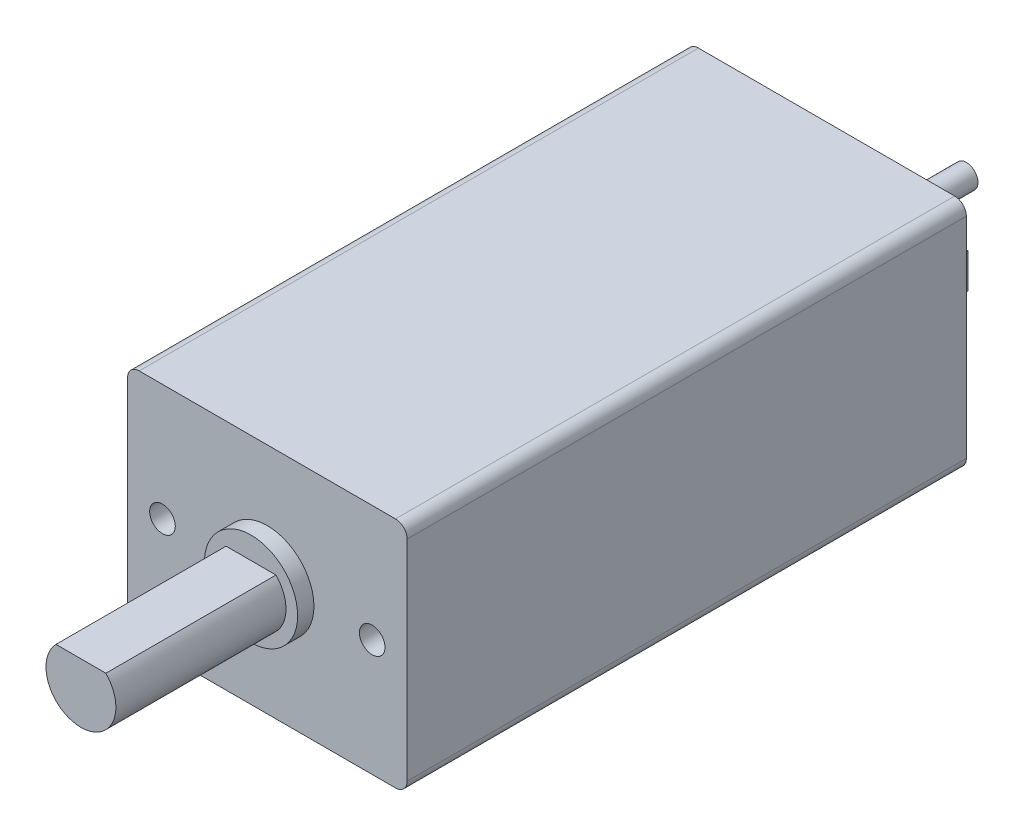
ISO-10303-21;
HEADER;
FILE_DESCRIPTION(('STEP AP214'),'2;1');
FILE_NAME('part.step','',(''),(''),'','','');
FILE_SCHEMA(('AUTOMOTIVE_DESIGN { 1 0 10303 214 1 1 1 1 }'));
ENDSEC;
DATA;
#1=APPLICATION_CONTEXT('core data for automotive mechanical design processes');
#2=APPLICATION_PROTOCOL_DEFINITION('international standard','automotive_design',2000,#1);
#3=PRODUCT_CONTEXT('',#1,'mechanical');
#4=PRODUCT('Part','Part','',(#3));
#5=PRODUCT_RELATED_PRODUCT_CATEGORY('part','',(#4));
#6=PRODUCT_DEFINITION_FORMATION('','',#4);
#7=PRODUCT_DEFINITION_CONTEXT('part definition',#1,'design');
#8=PRODUCT_DEFINITION('design','',#6,#7);
#9=PRODUCT_DEFINITION_SHAPE('','',#8);
#10=(LENGTH_UNIT() NAMED_UNIT(*) SI_UNIT(.MILLI.,.METRE.));
#11=(NAMED_UNIT(*) PLANE_ANGLE_UNIT() SI_UNIT($,.RADIAN.));
#12=(NAMED_UNIT(*) SI_UNIT($,.STERADIAN.) SOLID_ANGLE_UNIT());
#13=UNCERTAINTY_MEASURE_WITH_UNIT(LENGTH_MEASURE(1.E-05),#10,'distance_accuracy_value','');
#14=(GEOMETRIC_REPRESENTATION_CONTEXT(3) GLOBAL_UNCERTAINTY_ASSIGNED_CONTEXT((#13)) GLOBAL_UNIT_ASSIGNED_CONTEXT((#10,
#11,#12)) REPRESENTATION_CONTEXT('',''));
#15=CARTESIAN_POINT('',(0.,0.,0.));
#16=DIRECTION('',(0.,0.,1.));
#17=DIRECTION('',(1.,0.,0.));
#18=AXIS2_PLACEMENT_3D('',#15,#16,#17);
#19=CARTESIAN_POINT('',(0.,0.,-24.));
#20=DIRECTION('',(0.,0.,1.));
#21=DIRECTION('',(1.,0.,0.));
#22=AXIS2_PLACEMENT_3D('',#19,#20,#21);
#23=PLANE('',#22);
#24=DIRECTION('',(0.,1.,0.));
#25=VECTOR('',#24,1.);
#26=CARTESIAN_POINT('',(3.44,0.75,-24.));
#27=LINE('',#26,#25);
#28=CARTESIAN_POINT('',(3.44,-0.75,-24.));
#29=VERTEX_POINT('',#28);
#30=CARTESIAN_POINT('',(3.44,0.75,-24.));
#31=VERTEX_POINT('',#30);
#32=EDGE_CURVE('E187',#29,#31,#27,.T.);
#33=ORIENTED_EDGE('',*,*,#32,.F.);
#34=DIRECTION('',(-1.,0.,0.));
#35=VECTOR('',#34,1.);
#36=CARTESIAN_POINT('',(3.56,-0.75,-24.));
#37=LINE('',#36,#35);
#38=CARTESIAN_POINT('',(3.56,-0.75,-24.));
#39=VERTEX_POINT('',#38);
#40=EDGE_CURVE('E200',#39,#29,#37,.T.);
#41=ORIENTED_EDGE('',*,*,#40,.F.);
#42=DIRECTION('',(0.,-1.,0.));
#43=VECTOR('',#42,1.);
#44=CARTESIAN_POINT('',(3.56,0.75,-24.));
#45=LINE('',#44,#43);
#46=CARTESIAN_POINT('',(3.56,0.75,-24.));
#47=VERTEX_POINT('',#46);
#48=EDGE_CURVE('E209',#47,#39,#45,.T.);
#49=ORIENTED_EDGE('',*,*,#48,.F.);
#50=DIRECTION('',(1.,0.,0.));
#51=VECTOR('',#50,1.);
#52=CARTESIAN_POINT('',(3.56,0.75,-24.));
#53=LINE('',#52,#51);
#54=EDGE_CURVE('E190',#31,#47,#53,.T.);
#55=ORIENTED_EDGE('',*,*,#54,.F.);
#56=EDGE_LOOP('',(#33,#41,#49,#55));
#57=FACE_BOUND('',#56,.T.);
#58=DIRECTION('',(0.,-1.,0.));
#59=VECTOR('',#58,1.);
#60=CARTESIAN_POINT('',(-6.,5.,-24.));
#61=LINE('',#60,#59);
#62=CARTESIAN_POINT('',(-6.,4.5,-24.));
#63=VERTEX_POINT('',#62);
#64=CARTESIAN_POINT('',(-6.,-4.5,-24.));
#65=VERTEX_POINT('',#64);
#66=EDGE_CURVE('E260',#63,#65,#61,.T.);
#67=ORIENTED_EDGE('',*,*,#66,.F.);
#68=CARTESIAN_POINT('',(-5.5,4.5,-24.));
#69=DIRECTION('',(0.,0.,1.));
#70=DIRECTION('',(1.,0.,0.));
#71=AXIS2_PLACEMENT_3D('',#68,#69,#70);
#72=CIRCLE('',#71,0.5);
#73=CARTESIAN_POINT('',(-5.5,5.,-24.));
#74=VERTEX_POINT('',#73);
#75=EDGE_CURVE('E313',#63,#74,#72,.F.);
#76=ORIENTED_EDGE('',*,*,#75,.T.);
#77=DIRECTION('',(-1.,0.,0.));
#78=VECTOR('',#77,1.);
#79=CARTESIAN_POINT('',(-6.,5.,-24.));
#80=LINE('',#79,#78);
#81=CARTESIAN_POINT('',(5.5,5.,-24.));
#82=VERTEX_POINT('',#81);
#83=EDGE_CURVE('E270',#82,#74,#80,.T.);
#84=ORIENTED_EDGE('',*,*,#83,.F.);
#85=CARTESIAN_POINT('',(5.5,4.5,-24.));
#86=DIRECTION('',(0.,0.,1.));
#87=DIRECTION('',(1.,0.,0.));
#88=AXIS2_PLACEMENT_3D('',#85,#86,#87);
#89=CIRCLE('',#88,0.5);
#90=CARTESIAN_POINT('',(6.,4.5,-24.));
#91=VERTEX_POINT('',#90);
#92=EDGE_CURVE('E311',#82,#91,#89,.F.);
#93=ORIENTED_EDGE('',*,*,#92,.T.);
#94=DIRECTION('',(0.,1.,0.));
#95=VECTOR('',#94,1.);
#96=CARTESIAN_POINT('',(6.,5.,-24.));
#97=LINE('',#96,#95);
#98=CARTESIAN_POINT('',(6.,-4.5,-24.));
#99=VERTEX_POINT('',#98);
#100=EDGE_CURVE('E267',#99,#91,#97,.T.);
#101=ORIENTED_EDGE('',*,*,#100,.F.);
#102=CARTESIAN_POINT('',(5.5,-4.5,-24.));
#103=DIRECTION('',(0.,0.,1.));
#104=DIRECTION('',(1.,0.,0.));
#105=AXIS2_PLACEMENT_3D('',#102,#103,#104);
#106=CIRCLE('',#105,0.5);
#107=CARTESIAN_POINT('',(5.5,-5.,-24.));
#108=VERTEX_POINT('',#107);
#109=EDGE_CURVE('E309',#99,#108,#106,.F.);
#110=ORIENTED_EDGE('',*,*,#109,.T.);
#111=DIRECTION('',(1.,0.,0.));
#112=VECTOR('',#111,1.);
#113=CARTESIAN_POINT('',(-6.,-5.,-24.));
#114=LINE('',#113,#112);
#115=CARTESIAN_POINT('',(-5.5,-5.,-24.));
#116=VERTEX_POINT('',#115);
#117=EDGE_CURVE('E263',#116,#108,#114,.T.);
#118=ORIENTED_EDGE('',*,*,#117,.F.);
#119=CARTESIAN_POINT('',(-5.5,-4.5,-24.));
#120=DIRECTION('',(0.,0.,1.));
#121=DIRECTION('',(1.,0.,0.));
#122=AXIS2_PLACEMENT_3D('',#119,#120,#121);
#123=CIRCLE('',#122,0.5);
#124=EDGE_CURVE('E307',#116,#65,#123,.F.);
#125=ORIENTED_EDGE('',*,*,#124,.T.);
#126=EDGE_LOOP('',(#67,#76,#84,#93,#101,#110,#118,#125));
#127=FACE_BOUND('',#126,.T.);
#128=CARTESIAN_POINT('',(0.,0.,-24.));
#129=DIRECTION('',(0.,0.,1.));
#130=DIRECTION('',(1.,0.,0.));
#131=AXIS2_PLACEMENT_3D('',#128,#129,#130);
#132=CIRCLE('',#131,2.5);
#133=CARTESIAN_POINT('',(2.5,0.,-24.));
#134=VERTEX_POINT('',#133);
#135=EDGE_CURVE('E11',#134,#134,#132,.F.);
#136=ORIENTED_EDGE('',*,*,#135,.F.);
#137=EDGE_LOOP('',(#136));
#138=FACE_BOUND('',#137,.T.);
#139=DIRECTION('',(0.,1.,0.));
#140=VECTOR('',#139,1.);
#141=CARTESIAN_POINT('',(-3.56,0.75,-24.));
#142=LINE('',#141,#140);
#143=CARTESIAN_POINT('',(-3.56,-0.75,-24.));
#144=VERTEX_POINT('',#143);
#145=CARTESIAN_POINT('',(-3.56,0.75,-24.));
#146=VERTEX_POINT('',#145);
#147=EDGE_CURVE('E186',#144,#146,#142,.T.);
#148=ORIENTED_EDGE('',*,*,#147,.F.);
#149=DIRECTION('',(-1.,0.,0.));
#150=VECTOR('',#149,1.);
#151=CARTESIAN_POINT('',(-3.44,-0.75,-24.));
#152=LINE('',#151,#150);
#153=CARTESIAN_POINT('',(-3.44,-0.75,-24.));
#154=VERTEX_POINT('',#153);
#155=EDGE_CURVE('E183',#154,#144,#152,.T.);
#156=ORIENTED_EDGE('',*,*,#155,.F.);
#157=DIRECTION('',(0.,-1.,0.));
#158=VECTOR('',#157,1.);
#159=CARTESIAN_POINT('',(-3.44,0.75,-24.));
#160=LINE('',#159,#158);
#161=CARTESIAN_POINT('',(-3.44,0.75,-24.));
#162=VERTEX_POINT('',#161);
#163=EDGE_CURVE('E55',#162,#154,#160,.T.);
#164=ORIENTED_EDGE('',*,*,#163,.F.);
#165=DIRECTION('',(1.,0.,0.));
#166=VECTOR('',#165,1.);
#167=CARTESIAN_POINT('',(-3.44,0.75,-24.));
#168=LINE('',#167,#166);
#169=EDGE_CURVE('E50',#146,#162,#168,.T.);
#170=ORIENTED_EDGE('',*,*,#169,.F.);
#171=EDGE_LOOP('',(#148,#156,#164,#170));
#172=FACE_BOUND('',#171,.T.);
#173=ADVANCED_FACE('F34',(#57,#127,#138,#172),#23,.F.);
#174=CARTESIAN_POINT('',(0.,0.,-25.2));
#175=DIRECTION('',(0.,0.,-1.));
#176=DIRECTION('',(-1.,0.,0.));
#177=AXIS2_PLACEMENT_3D('',#174,#175,#176);
#178=PLANE('',#177);
#179=CARTESIAN_POINT('',(0.,0.,-25.2));
#180=DIRECTION('',(0.,0.,-1.));
#181=DIRECTION('',(-1.,0.,0.));
#182=AXIS2_PLACEMENT_3D('',#179,#180,#181);
#183=CIRCLE('',#182,2.5);
#184=CARTESIAN_POINT('',(-2.5,0.,-25.2));
#185=VERTEX_POINT('',#184);
#186=EDGE_CURVE('E228',#185,#185,#183,.T.);
#187=ORIENTED_EDGE('',*,*,#186,.T.);
#188=EDGE_LOOP('',(#187));
#189=FACE_BOUND('',#188,.T.);
#190=CARTESIAN_POINT('',(0.,0.,-25.2));
#191=DIRECTION('',(0.,0.,-1.));
#192=DIRECTION('',(-1.,0.,0.));
#193=AXIS2_PLACEMENT_3D('',#190,#191,#192);
#194=CIRCLE('',#193,0.5);
#195=CARTESIAN_POINT('',(-0.5,0.,-25.2));
#196=VERTEX_POINT('',#195);
#197=EDGE_CURVE('E38',#196,#196,#194,.F.);
#198=ORIENTED_EDGE('',*,*,#197,.T.);
#199=EDGE_LOOP('',(#198));
#200=FACE_BOUND('',#199,.T.);
#201=ADVANCED_FACE('F371',(#189,#200),#178,.T.);
#202=CARTESIAN_POINT('',(0.,0.,0.7));
#203=DIRECTION('',(0.,0.,1.));
#204=DIRECTION('',(1.,0.,0.));
#205=AXIS2_PLACEMENT_3D('',#202,#203,#204);
#206=PLANE('',#205);
#207=CARTESIAN_POINT('',(0.,0.,0.7));
#208=DIRECTION('',(0.,0.,1.));
#209=DIRECTION('',(1.,0.,0.));
#210=AXIS2_PLACEMENT_3D('',#207,#208,#209);
#211=CIRCLE('',#210,2.);
#212=CARTESIAN_POINT('',(2.,0.,0.7));
#213=VERTEX_POINT('',#212);
#214=EDGE_CURVE('E254',#213,#213,#211,.T.);
#215=ORIENTED_EDGE('',*,*,#214,.T.);
#216=EDGE_LOOP('',(#215));
#217=FACE_BOUND('',#216,.T.);
#218=DIRECTION('',(1.,0.,0.));
#219=VECTOR('',#218,1.);
#220=CARTESIAN_POINT('',(0.,1.05,0.7));
#221=LINE('',#220,#219);
#222=CARTESIAN_POINT('',(-1.07121426428143,1.05,0.7));
#223=VERTEX_POINT('',#222);
#224=CARTESIAN_POINT('',(1.07121426428143,1.05,0.7));
#225=VERTEX_POINT('',#224);
#226=EDGE_CURVE('E273',#223,#225,#221,.T.);
#227=ORIENTED_EDGE('',*,*,#226,.T.);
#228=CARTESIAN_POINT('',(0.,0.,0.7));
#229=DIRECTION('',(0.,0.,1.));
#230=DIRECTION('',(1.,0.,0.));
#231=AXIS2_PLACEMENT_3D('',#228,#229,#230);
#232=CIRCLE('',#231,1.5);
#233=EDGE_CURVE('E286',#225,#223,#232,.F.);
#234=ORIENTED_EDGE('',*,*,#233,.T.);
#235=EDGE_LOOP('',(#227,#234));
#236=FACE_BOUND('',#235,.T.);
#237=ADVANCED_FACE('F377',(#217,#236),#206,.T.);
#238=CARTESIAN_POINT('',(0.,0.,0.));
#239=DIRECTION('',(0.,0.,1.));
#240=DIRECTION('',(1.,0.,0.));
#241=AXIS2_PLACEMENT_3D('',#238,#239,#240);
#242=PLANE('',#241);
#243=CARTESIAN_POINT('',(4.5,0.,0.));
#244=DIRECTION('',(0.,0.,1.));
#245=DIRECTION('',(1.,0.,0.));
#246=AXIS2_PLACEMENT_3D('',#243,#244,#245);
#247=CIRCLE('',#246,0.54999999999999);
#248=CARTESIAN_POINT('',(5.04999999999999,0.,0.));
#249=VERTEX_POINT('',#248);
#250=EDGE_CURVE('E241',#249,#249,#247,.T.);
#251=ORIENTED_EDGE('',*,*,#250,.F.);
#252=EDGE_LOOP('',(#251));
#253=FACE_BOUND('',#252,.T.);
#254=CARTESIAN_POINT('',(-4.5,0.,0.));
#255=DIRECTION('',(0.,0.,1.));
#256=DIRECTION('',(1.,0.,0.));
#257=AXIS2_PLACEMENT_3D('',#254,#255,#256);
#258=CIRCLE('',#257,0.549999999999998);
#259=CARTESIAN_POINT('',(-3.95,0.,0.));
#260=VERTEX_POINT('',#259);
#261=EDGE_CURVE('E247',#260,#260,#258,.T.);
#262=ORIENTED_EDGE('',*,*,#261,.F.);
#263=EDGE_LOOP('',(#262));
#264=FACE_BOUND('',#263,.T.);
#265=DIRECTION('',(-1.,0.,0.));
#266=VECTOR('',#265,1.);
#267=CARTESIAN_POINT('',(-6.,5.,0.));
#268=LINE('',#267,#266);
#269=CARTESIAN_POINT('',(5.5,5.,0.));
#270=VERTEX_POINT('',#269);
#271=CARTESIAN_POINT('',(-5.5,5.,0.));
#272=VERTEX_POINT('',#271);
#273=EDGE_CURVE('E264',#270,#272,#268,.T.);
#274=ORIENTED_EDGE('',*,*,#273,.T.);
#275=CARTESIAN_POINT('',(-5.5,4.5,0.));
#276=DIRECTION('',(0.,0.,1.));
#277=DIRECTION('',(1.,0.,0.));
#278=AXIS2_PLACEMENT_3D('',#275,#276,#277);
#279=CIRCLE('',#278,0.5);
#280=CARTESIAN_POINT('',(-6.,4.5,0.));
#281=VERTEX_POINT('',#280);
#282=EDGE_CURVE('E300',#272,#281,#279,.T.);
#283=ORIENTED_EDGE('',*,*,#282,.T.);
#284=DIRECTION('',(0.,-1.,0.));
#285=VECTOR('',#284,1.);
#286=CARTESIAN_POINT('',(-6.,5.,0.));
#287=LINE('',#286,#285);
#288=CARTESIAN_POINT('',(-6.,-4.5,0.));
#289=VERTEX_POINT('',#288);
#290=EDGE_CURVE('E257',#281,#289,#287,.T.);
#291=ORIENTED_EDGE('',*,*,#290,.T.);
#292=CARTESIAN_POINT('',(-5.5,-4.5,0.));
#293=DIRECTION('',(0.,0.,1.));
#294=DIRECTION('',(1.,0.,0.));
#295=AXIS2_PLACEMENT_3D('',#292,#293,#294);
#296=CIRCLE('',#295,0.5);
#297=CARTESIAN_POINT('',(-5.5,-5.,0.));
#298=VERTEX_POINT('',#297);
#299=EDGE_CURVE('E294',#289,#298,#296,.T.);
#300=ORIENTED_EDGE('',*,*,#299,.T.);
#301=DIRECTION('',(1.,0.,0.));
#302=VECTOR('',#301,1.);
#303=CARTESIAN_POINT('',(-6.,-5.,0.));
#304=LINE('',#303,#302);
#305=CARTESIAN_POINT('',(5.5,-5.,0.));
#306=VERTEX_POINT('',#305);
#307=EDGE_CURVE('E276',#298,#306,#304,.T.);
#308=ORIENTED_EDGE('',*,*,#307,.T.);
#309=CARTESIAN_POINT('',(5.5,-4.5,0.));
#310=DIRECTION('',(0.,0.,1.));
#311=DIRECTION('',(1.,0.,0.));
#312=AXIS2_PLACEMENT_3D('',#309,#310,#311);
#313=CIRCLE('',#312,0.5);
#314=CARTESIAN_POINT('',(6.,-4.5,0.));
#315=VERTEX_POINT('',#314);
#316=EDGE_CURVE('E296',#306,#315,#313,.T.);
#317=ORIENTED_EDGE('',*,*,#316,.T.);
#318=DIRECTION('',(0.,1.,0.));
#319=VECTOR('',#318,1.);
#320=CARTESIAN_POINT('',(6.,5.,0.));
#321=LINE('',#320,#319);
#322=CARTESIAN_POINT('',(6.,4.5,0.));
#323=VERTEX_POINT('',#322);
#324=EDGE_CURVE('E279',#315,#323,#321,.T.);
#325=ORIENTED_EDGE('',*,*,#324,.T.);
#326=CARTESIAN_POINT('',(5.5,4.5,0.));
#327=DIRECTION('',(0.,0.,1.));
#328=DIRECTION('',(1.,0.,0.));
#329=AXIS2_PLACEMENT_3D('',#326,#327,#328);
#330=CIRCLE('',#329,0.5);
#331=EDGE_CURVE('E298',#323,#270,#330,.T.);
#332=ORIENTED_EDGE('',*,*,#331,.T.);
#333=EDGE_LOOP('',(#274,#283,#291,#300,#308,#317,#325,#332));
#334=FACE_BOUND('',#333,.T.);
#335=CARTESIAN_POINT('',(0.,0.,0.));
#336=DIRECTION('',(0.,0.,1.));
#337=DIRECTION('',(1.,0.,0.));
#338=AXIS2_PLACEMENT_3D('',#335,#336,#337);
#339=CIRCLE('',#338,2.);
#340=CARTESIAN_POINT('',(2.,0.,0.));
#341=VERTEX_POINT('',#340);
#342=EDGE_CURVE('E253',#341,#341,#339,.T.);
#343=ORIENTED_EDGE('',*,*,#342,.F.);
#344=EDGE_LOOP('',(#343));
#345=FACE_BOUND('',#344,.T.);
#346=ADVANCED_FACE('F332',(#253,#264,#334,#345),#242,.T.);
#347=CARTESIAN_POINT('',(-6.,5.,-24.));
#348=DIRECTION('',(-1.,0.,0.));
#349=DIRECTION('',(0.,-1.,0.));
#350=AXIS2_PLACEMENT_3D('',#347,#348,#349);
#351=PLANE('',#350);
#352=ORIENTED_EDGE('',*,*,#290,.F.);
#353=DIRECTION('',(0.,0.,1.));
#354=VECTOR('',#353,1.);
#355=CARTESIAN_POINT('',(-6.,4.5,-24.));
#356=LINE('',#355,#354);
#357=EDGE_CURVE('E305',#281,#63,#356,.F.);
#358=ORIENTED_EDGE('',*,*,#357,.T.);
#359=ORIENTED_EDGE('',*,*,#66,.T.);
#360=DIRECTION('',(0.,0.,1.));
#361=VECTOR('',#360,1.);
#362=CARTESIAN_POINT('',(-6.,-4.5,-24.));
#363=LINE('',#362,#361);
#364=EDGE_CURVE('E302',#65,#289,#363,.T.);
#365=ORIENTED_EDGE('',*,*,#364,.T.);
#366=EDGE_LOOP('',(#352,#358,#359,#365));
#367=FACE_BOUND('',#366,.T.);
#368=ADVANCED_FACE('F340',(#367),#351,.T.);
#369=CARTESIAN_POINT('',(-6.,5.,-24.));
#370=DIRECTION('',(0.,1.,0.));
#371=DIRECTION('',(0.,0.,1.));
#372=AXIS2_PLACEMENT_3D('',#369,#370,#371);
#373=PLANE('',#372);
#374=ORIENTED_EDGE('',*,*,#83,.T.);
#375=DIRECTION('',(0.,0.,1.));
#376=VECTOR('',#375,1.);
#377=CARTESIAN_POINT('',(-5.5,5.,-24.));
#378=LINE('',#377,#376);
#379=EDGE_CURVE('E291',#74,#272,#378,.T.);
#380=ORIENTED_EDGE('',*,*,#379,.T.);
#381=ORIENTED_EDGE('',*,*,#273,.F.);
#382=DIRECTION('',(0.,0.,1.));
#383=VECTOR('',#382,1.);
#384=CARTESIAN_POINT('',(5.5,5.,-24.));
#385=LINE('',#384,#383);
#386=EDGE_CURVE('E289',#270,#82,#385,.F.);
#387=ORIENTED_EDGE('',*,*,#386,.T.);
#388=EDGE_LOOP('',(#374,#380,#381,#387));
#389=FACE_BOUND('',#388,.T.);
#390=ADVANCED_FACE('F352',(#389),#373,.T.);
#391=CARTESIAN_POINT('',(6.,5.,-24.));
#392=DIRECTION('',(1.,0.,0.));
#393=DIRECTION('',(0.,1.,0.));
#394=AXIS2_PLACEMENT_3D('',#391,#392,#393);
#395=PLANE('',#394);
#396=ORIENTED_EDGE('',*,*,#100,.T.);
#397=DIRECTION('',(0.,0.,1.));
#398=VECTOR('',#397,1.);
#399=CARTESIAN_POINT('',(6.,4.5,-24.));
#400=LINE('',#399,#398);
#401=EDGE_CURVE('E317',#91,#323,#400,.T.);
#402=ORIENTED_EDGE('',*,*,#401,.T.);
#403=ORIENTED_EDGE('',*,*,#324,.F.);
#404=DIRECTION('',(0.,0.,1.));
#405=VECTOR('',#404,1.);
#406=CARTESIAN_POINT('',(6.,-4.5,-24.));
#407=LINE('',#406,#405);
#408=EDGE_CURVE('E315',#315,#99,#407,.F.);
#409=ORIENTED_EDGE('',*,*,#408,.T.);
#410=EDGE_LOOP('',(#396,#402,#403,#409));
#411=FACE_BOUND('',#410,.T.);
#412=ADVANCED_FACE('F359',(#411),#395,.T.);
#413=CARTESIAN_POINT('',(-6.,-5.,-24.));
#414=DIRECTION('',(0.,-1.,0.));
#415=DIRECTION('',(0.,0.,-1.));
#416=AXIS2_PLACEMENT_3D('',#413,#414,#415);
#417=PLANE('',#416);
#418=ORIENTED_EDGE('',*,*,#117,.T.);
#419=DIRECTION('',(0.,0.,1.));
#420=VECTOR('',#419,1.);
#421=CARTESIAN_POINT('',(5.5,-5.,-24.));
#422=LINE('',#421,#420);
#423=EDGE_CURVE('E43',#108,#306,#422,.T.);
#424=ORIENTED_EDGE('',*,*,#423,.T.);
#425=ORIENTED_EDGE('',*,*,#307,.F.);
#426=DIRECTION('',(0.,0.,1.));
#427=VECTOR('',#426,1.);
#428=CARTESIAN_POINT('',(-5.5,-5.,-24.));
#429=LINE('',#428,#427);
#430=EDGE_CURVE('E320',#298,#116,#429,.F.);
#431=ORIENTED_EDGE('',*,*,#430,.T.);
#432=EDGE_LOOP('',(#418,#424,#425,#431));
#433=FACE_BOUND('',#432,.T.);
#434=ADVANCED_FACE('F326',(#433),#417,.T.);
#435=CARTESIAN_POINT('',(0.,0.,0.7));
#436=DIRECTION('',(0.,0.,-1.));
#437=DIRECTION('',(-1.,0.,0.));
#438=AXIS2_PLACEMENT_3D('',#435,#436,#437);
#439=CYLINDRICAL_SURFACE('',#438,2.);
#440=ORIENTED_EDGE('',*,*,#214,.F.);
#441=EDGE_LOOP('',(#440));
#442=FACE_BOUND('',#441,.T.);
#443=ORIENTED_EDGE('',*,*,#342,.T.);
#444=EDGE_LOOP('',(#443));
#445=FACE_BOUND('',#444,.T.);
#446=ADVANCED_FACE('F382',(#442,#445),#439,.T.);
#447=CARTESIAN_POINT('',(-4.5,0.,-10.));
#448=DIRECTION('',(0.,0.,1.));
#449=DIRECTION('',(1.,0.,0.));
#450=AXIS2_PLACEMENT_3D('',#447,#448,#449);
#451=CONICAL_SURFACE('',#450,0.549999999999997,1.02101761241668);
#452=CARTESIAN_POINT('',(-4.5,0.,-10.337040433477));
#453=VERTEX_POINT('',#452);
#454=VERTEX_LOOP('',#453);
#455=FACE_BOUND('',#454,.T.);
#456=CARTESIAN_POINT('',(-4.5,0.,-10.));
#457=DIRECTION('',(0.,0.,1.));
#458=DIRECTION('',(1.,0.,0.));
#459=AXIS2_PLACEMENT_3D('',#456,#457,#458);
#460=CIRCLE('',#459,0.549999999999997);
#461=CARTESIAN_POINT('',(-3.95,0.,-10.));
#462=VERTEX_POINT('',#461);
#463=EDGE_CURVE('E250',#462,#462,#460,.T.);
#464=ORIENTED_EDGE('',*,*,#463,.T.);
#465=EDGE_LOOP('',(#464));
#466=FACE_BOUND('',#465,.T.);
#467=ADVANCED_FACE('F425',(#455,#466),#451,.F.);
#468=CARTESIAN_POINT('',(-4.5,0.,0.));
#469=DIRECTION('',(0.,0.,1.));
#470=DIRECTION('',(1.,0.,0.));
#471=AXIS2_PLACEMENT_3D('',#468,#469,#470);
#472=CYLINDRICAL_SURFACE('',#471,0.549999999999998);
#473=ORIENTED_EDGE('',*,*,#463,.F.);
#474=EDGE_LOOP('',(#473));
#475=FACE_BOUND('',#474,.T.);
#476=ORIENTED_EDGE('',*,*,#261,.T.);
#477=EDGE_LOOP('',(#476));
#478=FACE_BOUND('',#477,.T.);
#479=ADVANCED_FACE('F421',(#475,#478),#472,.F.);
#480=CARTESIAN_POINT('',(4.5,0.,-9.99999999999999));
#481=DIRECTION('',(0.,0.,1.));
#482=DIRECTION('',(1.,0.,0.));
#483=AXIS2_PLACEMENT_3D('',#480,#481,#482);
#484=CONICAL_SURFACE('',#483,0.549999999999988,1.02101761241666);
#485=CARTESIAN_POINT('',(4.5,0.,-10.337040433477));
#486=VERTEX_POINT('',#485);
#487=VERTEX_LOOP('',#486);
#488=FACE_BOUND('',#487,.T.);
#489=CARTESIAN_POINT('',(4.5,0.,-9.99999999999999));
#490=DIRECTION('',(0.,0.,1.));
#491=DIRECTION('',(1.,0.,0.));
#492=AXIS2_PLACEMENT_3D('',#489,#490,#491);
#493=CIRCLE('',#492,0.549999999999988);
#494=CARTESIAN_POINT('',(5.04999999999999,0.,-9.99999999999999));
#495=VERTEX_POINT('',#494);
#496=EDGE_CURVE('E244',#495,#495,#493,.T.);
#497=ORIENTED_EDGE('',*,*,#496,.T.);
#498=EDGE_LOOP('',(#497));
#499=FACE_BOUND('',#498,.T.);
#500=ADVANCED_FACE('F417',(#488,#499),#484,.F.);
#501=CARTESIAN_POINT('',(4.5,0.,0.));
#502=DIRECTION('',(0.,0.,1.));
#503=DIRECTION('',(1.,0.,0.));
#504=AXIS2_PLACEMENT_3D('',#501,#502,#503);
#505=CYLINDRICAL_SURFACE('',#504,0.549999999999989);
#506=ORIENTED_EDGE('',*,*,#496,.F.);
#507=EDGE_LOOP('',(#506));
#508=FACE_BOUND('',#507,.T.);
#509=ORIENTED_EDGE('',*,*,#250,.T.);
#510=EDGE_LOOP('',(#509));
#511=FACE_BOUND('',#510,.T.);
#512=ADVANCED_FACE('F413',(#508,#511),#505,.F.);
#513=CARTESIAN_POINT('',(0.,0.,8.));
#514=DIRECTION('',(0.,0.,-1.));
#515=DIRECTION('',(-1.,0.,0.));
#516=AXIS2_PLACEMENT_3D('',#513,#514,#515);
#517=CYLINDRICAL_SURFACE('',#516,1.5);
#518=ORIENTED_EDGE('',*,*,#233,.F.);
#519=DIRECTION('',(0.,0.,-1.));
#520=VECTOR('',#519,1.);
#521=CARTESIAN_POINT('',(1.07121426428143,1.05,8.));
#522=LINE('',#521,#520);
#523=CARTESIAN_POINT('',(1.07121426428143,1.05,8.));
#524=VERTEX_POINT('',#523);
#525=EDGE_CURVE('E239',#524,#225,#522,.T.);
#526=ORIENTED_EDGE('',*,*,#525,.F.);
#527=CARTESIAN_POINT('',(0.,0.,8.));
#528=DIRECTION('',(0.,0.,1.));
#529=DIRECTION('',(1.,0.,0.));
#530=AXIS2_PLACEMENT_3D('',#527,#528,#529);
#531=CIRCLE('',#530,1.5);
#532=CARTESIAN_POINT('',(-1.07121426428143,1.05,8.));
#533=VERTEX_POINT('',#532);
#534=EDGE_CURVE('E231',#533,#524,#531,.T.);
#535=ORIENTED_EDGE('',*,*,#534,.F.);
#536=DIRECTION('',(0.,0.,-1.));
#537=VECTOR('',#536,1.);
#538=CARTESIAN_POINT('',(-1.07121426428143,1.05,8.));
#539=LINE('',#538,#537);
#540=EDGE_CURVE('E236',#533,#223,#539,.T.);
#541=ORIENTED_EDGE('',*,*,#540,.T.);
#542=EDGE_LOOP('',(#518,#526,#535,#541));
#543=FACE_BOUND('',#542,.T.);
#544=ADVANCED_FACE('F406',(#543),#517,.T.);
#545=CARTESIAN_POINT('',(-1.07121426428143,1.05,8.));
#546=DIRECTION('',(0.,-1.,0.));
#547=DIRECTION('',(0.,0.,-1.));
#548=AXIS2_PLACEMENT_3D('',#545,#546,#547);
#549=PLANE('',#548);
#550=ORIENTED_EDGE('',*,*,#226,.F.);
#551=ORIENTED_EDGE('',*,*,#540,.F.);
#552=DIRECTION('',(-1.,0.,0.));
#553=VECTOR('',#552,1.);
#554=CARTESIAN_POINT('',(-1.07121426428143,1.05,8.));
#555=LINE('',#554,#553);
#556=EDGE_CURVE('E234',#524,#533,#555,.T.);
#557=ORIENTED_EDGE('',*,*,#556,.F.);
#558=ORIENTED_EDGE('',*,*,#525,.T.);
#559=EDGE_LOOP('',(#550,#551,#557,#558));
#560=FACE_BOUND('',#559,.T.);
#561=ADVANCED_FACE('F400',(#560),#549,.F.);
#562=CARTESIAN_POINT('',(0.,0.,8.));
#563=DIRECTION('',(0.,0.,1.));
#564=DIRECTION('',(1.,0.,0.));
#565=AXIS2_PLACEMENT_3D('',#562,#563,#564);
#566=PLANE('',#565);
#567=ORIENTED_EDGE('',*,*,#534,.T.);
#568=ORIENTED_EDGE('',*,*,#556,.T.);
#569=EDGE_LOOP('',(#567,#568));
#570=FACE_BOUND('',#569,.T.);
#571=ADVANCED_FACE('F396',(#570),#566,.T.);
#572=CARTESIAN_POINT('',(-5.5,4.5,-24.));
#573=DIRECTION('',(0.,0.,1.));
#574=DIRECTION('',(1.,0.,0.));
#575=AXIS2_PLACEMENT_3D('',#572,#573,#574);
#576=CYLINDRICAL_SURFACE('',#575,0.5);
#577=ORIENTED_EDGE('',*,*,#75,.F.);
#578=ORIENTED_EDGE('',*,*,#357,.F.);
#579=ORIENTED_EDGE('',*,*,#282,.F.);
#580=ORIENTED_EDGE('',*,*,#379,.F.);
#581=EDGE_LOOP('',(#577,#578,#579,#580));
#582=FACE_BOUND('',#581,.T.);
#583=ADVANCED_FACE('F349',(#582),#576,.T.);
#584=CARTESIAN_POINT('',(5.5,4.5,-24.));
#585=DIRECTION('',(0.,0.,1.));
#586=DIRECTION('',(1.,0.,0.));
#587=AXIS2_PLACEMENT_3D('',#584,#585,#586);
#588=CYLINDRICAL_SURFACE('',#587,0.5);
#589=ORIENTED_EDGE('',*,*,#92,.F.);
#590=ORIENTED_EDGE('',*,*,#386,.F.);
#591=ORIENTED_EDGE('',*,*,#331,.F.);
#592=ORIENTED_EDGE('',*,*,#401,.F.);
#593=EDGE_LOOP('',(#589,#590,#591,#592));
#594=FACE_BOUND('',#593,.T.);
#595=ADVANCED_FACE('F357',(#594),#588,.T.);
#596=CARTESIAN_POINT('',(5.5,-4.5,-24.));
#597=DIRECTION('',(0.,0.,1.));
#598=DIRECTION('',(1.,0.,0.));
#599=AXIS2_PLACEMENT_3D('',#596,#597,#598);
#600=CYLINDRICAL_SURFACE('',#599,0.5);
#601=ORIENTED_EDGE('',*,*,#109,.F.);
#602=ORIENTED_EDGE('',*,*,#408,.F.);
#603=ORIENTED_EDGE('',*,*,#316,.F.);
#604=ORIENTED_EDGE('',*,*,#423,.F.);
#605=EDGE_LOOP('',(#601,#602,#603,#604));
#606=FACE_BOUND('',#605,.T.);
#607=ADVANCED_FACE('F362',(#606),#600,.T.);
#608=CARTESIAN_POINT('',(-5.5,-4.5,-24.));
#609=DIRECTION('',(0.,0.,1.));
#610=DIRECTION('',(1.,0.,0.));
#611=AXIS2_PLACEMENT_3D('',#608,#609,#610);
#612=CYLINDRICAL_SURFACE('',#611,0.5);
#613=ORIENTED_EDGE('',*,*,#124,.F.);
#614=ORIENTED_EDGE('',*,*,#430,.F.);
#615=ORIENTED_EDGE('',*,*,#299,.F.);
#616=ORIENTED_EDGE('',*,*,#364,.F.);
#617=EDGE_LOOP('',(#613,#614,#615,#616));
#618=FACE_BOUND('',#617,.T.);
#619=ADVANCED_FACE('F36',(#618),#612,.T.);
#620=CARTESIAN_POINT('',(0.,0.,-25.2));
#621=DIRECTION('',(0.,0.,1.));
#622=DIRECTION('',(1.,0.,0.));
#623=AXIS2_PLACEMENT_3D('',#620,#621,#622);
#624=CYLINDRICAL_SURFACE('',#623,2.5);
#625=ORIENTED_EDGE('',*,*,#186,.F.);
#626=EDGE_LOOP('',(#625));
#627=FACE_BOUND('',#626,.T.);
#628=ORIENTED_EDGE('',*,*,#135,.T.);
#629=EDGE_LOOP('',(#628));
#630=FACE_BOUND('',#629,.T.);
#631=ADVANCED_FACE('F368',(#627,#630),#624,.T.);
#632=CARTESIAN_POINT('',(0.,0.,-30.));
#633=DIRECTION('',(0.,0.,1.));
#634=DIRECTION('',(1.,0.,0.));
#635=AXIS2_PLACEMENT_3D('',#632,#633,#634);
#636=CYLINDRICAL_SURFACE('',#635,0.5);
#637=ORIENTED_EDGE('',*,*,#197,.F.);
#638=EDGE_LOOP('',(#637));
#639=FACE_BOUND('',#638,.T.);
#640=CARTESIAN_POINT('',(0.,0.,-30.));
#641=DIRECTION('',(0.,0.,-1.));
#642=DIRECTION('',(-1.,0.,0.));
#643=AXIS2_PLACEMENT_3D('',#640,#641,#642);
#644=CIRCLE('',#643,0.5);
#645=CARTESIAN_POINT('',(-0.5,0.,-30.));
#646=VERTEX_POINT('',#645);
#647=EDGE_CURVE('E225',#646,#646,#644,.T.);
#648=ORIENTED_EDGE('',*,*,#647,.F.);
#649=EDGE_LOOP('',(#648));
#650=FACE_BOUND('',#649,.T.);
#651=ADVANCED_FACE('F486',(#639,#650),#636,.T.);
#652=CARTESIAN_POINT('',(0.,0.,-30.));
#653=DIRECTION('',(0.,0.,-1.));
#654=DIRECTION('',(-1.,0.,0.));
#655=AXIS2_PLACEMENT_3D('',#652,#653,#654);
#656=PLANE('',#655);
#657=ORIENTED_EDGE('',*,*,#647,.T.);
#658=EDGE_LOOP('',(#657));
#659=FACE_BOUND('',#658,.T.);
#660=ADVANCED_FACE('F502',(#659),#656,.T.);
#661=CARTESIAN_POINT('',(3.44,0.75,-26.5));
#662=DIRECTION('',(1.,0.,0.));
#663=DIRECTION('',(0.,0.,-1.));
#664=AXIS2_PLACEMENT_3D('',#661,#662,#663);
#665=PLANE('',#664);
#666=CARTESIAN_POINT('',(3.44,0.,-25.7));
#667=DIRECTION('',(1.,0.,0.));
#668=DIRECTION('',(0.,0.,-1.));
#669=AXIS2_PLACEMENT_3D('',#666,#667,#668);
#670=CIRCLE('',#669,0.400000000000001);
#671=CARTESIAN_POINT('',(3.44,0.,-26.1));
#672=VERTEX_POINT('',#671);
#673=EDGE_CURVE('E640',#672,#672,#670,.F.);
#674=ORIENTED_EDGE('',*,*,#673,.F.);
#675=EDGE_LOOP('',(#674));
#676=FACE_BOUND('',#675,.T.);
#677=ORIENTED_EDGE('',*,*,#32,.T.);
#678=DIRECTION('',(0.,0.,1.));
#679=VECTOR('',#678,1.);
#680=CARTESIAN_POINT('',(3.44,0.75,-26.5));
#681=LINE('',#680,#679);
#682=CARTESIAN_POINT('',(3.44,0.75,-26.5));
#683=VERTEX_POINT('',#682);
#684=EDGE_CURVE('E222',#683,#31,#681,.T.);
#685=ORIENTED_EDGE('',*,*,#684,.F.);
#686=DIRECTION('',(0.,1.,0.));
#687=VECTOR('',#686,1.);
#688=CARTESIAN_POINT('',(3.44,0.75,-26.5));
#689=LINE('',#688,#687);
#690=CARTESIAN_POINT('',(3.44,-0.75,-26.5));
#691=VERTEX_POINT('',#690);
#692=EDGE_CURVE('E196',#691,#683,#689,.T.);
#693=ORIENTED_EDGE('',*,*,#692,.F.);
#694=DIRECTION('',(0.,0.,1.));
#695=VECTOR('',#694,1.);
#696=CARTESIAN_POINT('',(3.44,-0.75,-26.5));
#697=LINE('',#696,#695);
#698=EDGE_CURVE('E205',#691,#29,#697,.T.);
#699=ORIENTED_EDGE('',*,*,#698,.T.);
#700=EDGE_LOOP('',(#677,#685,#693,#699));
#701=FACE_BOUND('',#700,.T.);
#702=ADVANCED_FACE('F512',(#676,#701),#665,.F.);
#703=CARTESIAN_POINT('',(3.56,0.75,-26.5));
#704=DIRECTION('',(0.,-1.,0.));
#705=DIRECTION('',(0.,0.,-1.));
#706=AXIS2_PLACEMENT_3D('',#703,#704,#705);
#707=PLANE('',#706);
#708=ORIENTED_EDGE('',*,*,#54,.T.);
#709=DIRECTION('',(0.,0.,1.));
#710=VECTOR('',#709,1.);
#711=CARTESIAN_POINT('',(3.56,0.75,-26.5));
#712=LINE('',#711,#710);
#713=CARTESIAN_POINT('',(3.56,0.75,-26.5));
#714=VERTEX_POINT('',#713);
#715=EDGE_CURVE('E219',#714,#47,#712,.T.);
#716=ORIENTED_EDGE('',*,*,#715,.F.);
#717=DIRECTION('',(1.,0.,0.));
#718=VECTOR('',#717,1.);
#719=CARTESIAN_POINT('',(3.56,0.75,-26.5));
#720=LINE('',#719,#718);
#721=EDGE_CURVE('E199',#683,#714,#720,.T.);
#722=ORIENTED_EDGE('',*,*,#721,.F.);
#723=ORIENTED_EDGE('',*,*,#684,.T.);
#724=EDGE_LOOP('',(#708,#716,#722,#723));
#725=FACE_BOUND('',#724,.T.);
#726=ADVANCED_FACE('F544',(#725),#707,.F.);
#727=CARTESIAN_POINT('',(3.56,0.75,-26.5));
#728=DIRECTION('',(-1.,0.,0.));
#729=DIRECTION('',(0.,0.,1.));
#730=AXIS2_PLACEMENT_3D('',#727,#728,#729);
#731=PLANE('',#730);
#732=CARTESIAN_POINT('',(3.56,0.,-25.7));
#733=DIRECTION('',(1.,0.,0.));
#734=DIRECTION('',(0.,0.,-1.));
#735=AXIS2_PLACEMENT_3D('',#732,#733,#734);
#736=CIRCLE('',#735,0.400000000000001);
#737=CARTESIAN_POINT('',(3.56,0.,-26.1));
#738=VERTEX_POINT('',#737);
#739=EDGE_CURVE('E637',#738,#738,#736,.T.);
#740=ORIENTED_EDGE('',*,*,#739,.F.);
#741=EDGE_LOOP('',(#740));
#742=FACE_BOUND('',#741,.T.);
#743=ORIENTED_EDGE('',*,*,#48,.T.);
#744=DIRECTION('',(0.,0.,1.));
#745=VECTOR('',#744,1.);
#746=CARTESIAN_POINT('',(3.56,-0.75,-26.5));
#747=LINE('',#746,#745);
#748=CARTESIAN_POINT('',(3.56,-0.75,-26.5));
#749=VERTEX_POINT('',#748);
#750=EDGE_CURVE('E216',#749,#39,#747,.T.);
#751=ORIENTED_EDGE('',*,*,#750,.F.);
#752=DIRECTION('',(0.,-1.,0.));
#753=VECTOR('',#752,1.);
#754=CARTESIAN_POINT('',(3.56,0.75,-26.5));
#755=LINE('',#754,#753);
#756=EDGE_CURVE('E202',#714,#749,#755,.T.);
#757=ORIENTED_EDGE('',*,*,#756,.F.);
#758=ORIENTED_EDGE('',*,*,#715,.T.);
#759=EDGE_LOOP('',(#743,#751,#757,#758));
#760=FACE_BOUND('',#759,.T.);
#761=ADVANCED_FACE('F536',(#742,#760),#731,.F.);
#762=CARTESIAN_POINT('',(3.56,-0.75,-26.5));
#763=DIRECTION('',(0.,1.,0.));
#764=DIRECTION('',(0.,0.,1.));
#765=AXIS2_PLACEMENT_3D('',#762,#763,#764);
#766=PLANE('',#765);
#767=ORIENTED_EDGE('',*,*,#40,.T.);
#768=ORIENTED_EDGE('',*,*,#698,.F.);
#769=DIRECTION('',(-1.,0.,0.));
#770=VECTOR('',#769,1.);
#771=CARTESIAN_POINT('',(3.56,-0.75,-26.5));
#772=LINE('',#771,#770);
#773=EDGE_CURVE('E204',#749,#691,#772,.T.);
#774=ORIENTED_EDGE('',*,*,#773,.F.);
#775=ORIENTED_EDGE('',*,*,#750,.T.);
#776=EDGE_LOOP('',(#767,#768,#774,#775));
#777=FACE_BOUND('',#776,.T.);
#778=ADVANCED_FACE('F524',(#777),#766,.F.);
#779=CARTESIAN_POINT('',(0.,0.,-26.5));
#780=DIRECTION('',(0.,0.,-1.));
#781=DIRECTION('',(-1.,0.,0.));
#782=AXIS2_PLACEMENT_3D('',#779,#780,#781);
#783=PLANE('',#782);
#784=ORIENTED_EDGE('',*,*,#692,.T.);
#785=ORIENTED_EDGE('',*,*,#721,.T.);
#786=ORIENTED_EDGE('',*,*,#756,.T.);
#787=ORIENTED_EDGE('',*,*,#773,.T.);
#788=EDGE_LOOP('',(#784,#785,#786,#787));
#789=FACE_BOUND('',#788,.T.);
#790=ADVANCED_FACE('F519',(#789),#783,.T.);
#791=CARTESIAN_POINT('',(-3.56,0.75,-26.5));
#792=DIRECTION('',(1.,0.,0.));
#793=DIRECTION('',(0.,0.,-1.));
#794=AXIS2_PLACEMENT_3D('',#791,#792,#793);
#795=PLANE('',#794);
#796=CARTESIAN_POINT('',(-3.56,0.,-25.7));
#797=DIRECTION('',(-1.,0.,0.));
#798=DIRECTION('',(0.,0.,1.));
#799=AXIS2_PLACEMENT_3D('',#796,#797,#798);
#800=CIRCLE('',#799,0.400000000000001);
#801=CARTESIAN_POINT('',(-3.56,0.,-25.3));
#802=VERTEX_POINT('',#801);
#803=EDGE_CURVE('E647',#802,#802,#800,.T.);
#804=ORIENTED_EDGE('',*,*,#803,.F.);
#805=EDGE_LOOP('',(#804));
#806=FACE_BOUND('',#805,.T.);
#807=ORIENTED_EDGE('',*,*,#147,.T.);
#808=DIRECTION('',(0.,0.,1.));
#809=VECTOR('',#808,1.);
#810=CARTESIAN_POINT('',(-3.56,0.75,-26.5));
#811=LINE('',#810,#809);
#812=CARTESIAN_POINT('',(-3.56,0.75,-26.5));
#813=VERTEX_POINT('',#812);
#814=EDGE_CURVE('E167',#813,#146,#811,.T.);
#815=ORIENTED_EDGE('',*,*,#814,.F.);
#816=DIRECTION('',(0.,1.,0.));
#817=VECTOR('',#816,1.);
#818=CARTESIAN_POINT('',(-3.56,0.75,-26.5));
#819=LINE('',#818,#817);
#820=CARTESIAN_POINT('',(-3.56,-0.75,-26.5));
#821=VERTEX_POINT('',#820);
#822=EDGE_CURVE('E174',#821,#813,#819,.T.);
#823=ORIENTED_EDGE('',*,*,#822,.F.);
#824=DIRECTION('',(0.,0.,1.));
#825=VECTOR('',#824,1.);
#826=CARTESIAN_POINT('',(-3.56,-0.75,-26.5));
#827=LINE('',#826,#825);
#828=EDGE_CURVE('E652',#821,#144,#827,.T.);
#829=ORIENTED_EDGE('',*,*,#828,.T.);
#830=EDGE_LOOP('',(#807,#815,#823,#829));
#831=FACE_BOUND('',#830,.T.);
#832=ADVANCED_FACE('F185',(#806,#831),#795,.F.);
#833=CARTESIAN_POINT('',(-3.44,0.75,-26.5));
#834=DIRECTION('',(0.,-1.,0.));
#835=DIRECTION('',(0.,0.,-1.));
#836=AXIS2_PLACEMENT_3D('',#833,#834,#835);
#837=PLANE('',#836);
#838=ORIENTED_EDGE('',*,*,#169,.T.);
#839=DIRECTION('',(0.,0.,1.));
#840=VECTOR('',#839,1.);
#841=CARTESIAN_POINT('',(-3.44,0.75,-26.5));
#842=LINE('',#841,#840);
#843=CARTESIAN_POINT('',(-3.44,0.75,-26.5));
#844=VERTEX_POINT('',#843);
#845=EDGE_CURVE('E170',#844,#162,#842,.T.);
#846=ORIENTED_EDGE('',*,*,#845,.F.);
#847=DIRECTION('',(1.,0.,0.));
#848=VECTOR('',#847,1.);
#849=CARTESIAN_POINT('',(-3.44,0.75,-26.5));
#850=LINE('',#849,#848);
#851=EDGE_CURVE('E163',#813,#844,#850,.T.);
#852=ORIENTED_EDGE('',*,*,#851,.F.);
#853=ORIENTED_EDGE('',*,*,#814,.T.);
#854=EDGE_LOOP('',(#838,#846,#852,#853));
#855=FACE_BOUND('',#854,.T.);
#856=ADVANCED_FACE('F165',(#855),#837,.F.);
#857=CARTESIAN_POINT('',(-3.44,0.75,-26.5));
#858=DIRECTION('',(-1.,0.,0.));
#859=DIRECTION('',(0.,0.,1.));
#860=AXIS2_PLACEMENT_3D('',#857,#858,#859);
#861=PLANE('',#860);
#862=CARTESIAN_POINT('',(-3.44,0.,-25.7));
#863=DIRECTION('',(-1.,0.,0.));
#864=DIRECTION('',(0.,0.,1.));
#865=AXIS2_PLACEMENT_3D('',#862,#863,#864);
#866=CIRCLE('',#865,0.400000000000001);
#867=CARTESIAN_POINT('',(-3.44,0.,-25.3));
#868=VERTEX_POINT('',#867);
#869=EDGE_CURVE('E642',#868,#868,#866,.F.);
#870=ORIENTED_EDGE('',*,*,#869,.F.);
#871=EDGE_LOOP('',(#870));
#872=FACE_BOUND('',#871,.T.);
#873=ORIENTED_EDGE('',*,*,#163,.T.);
#874=DIRECTION('',(0.,0.,1.));
#875=VECTOR('',#874,1.);
#876=CARTESIAN_POINT('',(-3.44,-0.75,-26.5));
#877=LINE('',#876,#875);
#878=CARTESIAN_POINT('',(-3.44,-0.75,-26.5));
#879=VERTEX_POINT('',#878);
#880=EDGE_CURVE('E192',#879,#154,#877,.T.);
#881=ORIENTED_EDGE('',*,*,#880,.F.);
#882=DIRECTION('',(0.,-1.,0.));
#883=VECTOR('',#882,1.);
#884=CARTESIAN_POINT('',(-3.44,0.75,-26.5));
#885=LINE('',#884,#883);
#886=EDGE_CURVE('E173',#844,#879,#885,.T.);
#887=ORIENTED_EDGE('',*,*,#886,.F.);
#888=ORIENTED_EDGE('',*,*,#845,.T.);
#889=EDGE_LOOP('',(#873,#881,#887,#888));
#890=FACE_BOUND('',#889,.T.);
#891=ADVANCED_FACE('F556',(#872,#890),#861,.F.);
#892=CARTESIAN_POINT('',(-3.44,-0.75,-26.5));
#893=DIRECTION('',(0.,1.,0.));
#894=DIRECTION('',(0.,0.,1.));
#895=AXIS2_PLACEMENT_3D('',#892,#893,#894);
#896=PLANE('',#895);
#897=ORIENTED_EDGE('',*,*,#155,.T.);
#898=ORIENTED_EDGE('',*,*,#828,.F.);
#899=DIRECTION('',(-1.,0.,0.));
#900=VECTOR('',#899,1.);
#901=CARTESIAN_POINT('',(-3.44,-0.75,-26.5));
#902=LINE('',#901,#900);
#903=EDGE_CURVE('E179',#879,#821,#902,.T.);
#904=ORIENTED_EDGE('',*,*,#903,.F.);
#905=ORIENTED_EDGE('',*,*,#880,.T.);
#906=EDGE_LOOP('',(#897,#898,#904,#905));
#907=FACE_BOUND('',#906,.T.);
#908=ADVANCED_FACE('F568',(#907),#896,.F.);
#909=CARTESIAN_POINT('',(0.,0.,-26.5));
#910=DIRECTION('',(0.,0.,-1.));
#911=DIRECTION('',(-1.,0.,0.));
#912=AXIS2_PLACEMENT_3D('',#909,#910,#911);
#913=PLANE('',#912);
#914=ORIENTED_EDGE('',*,*,#822,.T.);
#915=ORIENTED_EDGE('',*,*,#851,.T.);
#916=ORIENTED_EDGE('',*,*,#886,.T.);
#917=ORIENTED_EDGE('',*,*,#903,.T.);
#918=EDGE_LOOP('',(#914,#915,#916,#917));
#919=FACE_BOUND('',#918,.T.);
#920=ADVANCED_FACE('F177',(#919),#913,.T.);
#921=CARTESIAN_POINT('',(6.001,0.,-25.7));
#922=DIRECTION('',(-1.,0.,0.));
#923=DIRECTION('',(0.,0.,1.));
#924=AXIS2_PLACEMENT_3D('',#921,#922,#923);
#925=CYLINDRICAL_SURFACE('',#924,0.400000000000001);
#926=ORIENTED_EDGE('',*,*,#803,.T.);
#927=EDGE_LOOP('',(#926));
#928=FACE_BOUND('',#927,.T.);
#929=ORIENTED_EDGE('',*,*,#869,.T.);
#930=EDGE_LOOP('',(#929));
#931=FACE_BOUND('',#930,.T.);
#932=ADVANCED_FACE('F567',(#928,#931),#925,.F.);
#933=CARTESIAN_POINT('',(-6.001,0.,-25.7));
#934=DIRECTION('',(1.,0.,0.));
#935=DIRECTION('',(0.,0.,-1.));
#936=AXIS2_PLACEMENT_3D('',#933,#934,#935);
#937=CYLINDRICAL_SURFACE('',#936,0.400000000000001);
#938=ORIENTED_EDGE('',*,*,#739,.T.);
#939=EDGE_LOOP('',(#938));
#940=FACE_BOUND('',#939,.T.);
#941=ORIENTED_EDGE('',*,*,#673,.T.);
#942=EDGE_LOOP('',(#941));
#943=FACE_BOUND('',#942,.T.);
#944=ADVANCED_FACE('F620',(#940,#943),#937,.F.);
#945=CLOSED_SHELL('',(#173,#201,#237,#346,#368,#390,#412,#434,#446,#467,#479,#500,#512,#544,
#561,#571,#583,#595,#607,#619,#631,#651,#660,#702,#726,#761,#778,#790,#832,#856,#891,#908,#920,
#932,#944));
#946=MANIFOLD_SOLID_BREP('B2',#945);
#947=ADVANCED_BREP_SHAPE_REPRESENTATION('',(#18,#946),#14);
#948=SHAPE_DEFINITION_REPRESENTATION(#9,#947);
ENDSEC;
END-ISO-10303-21;
